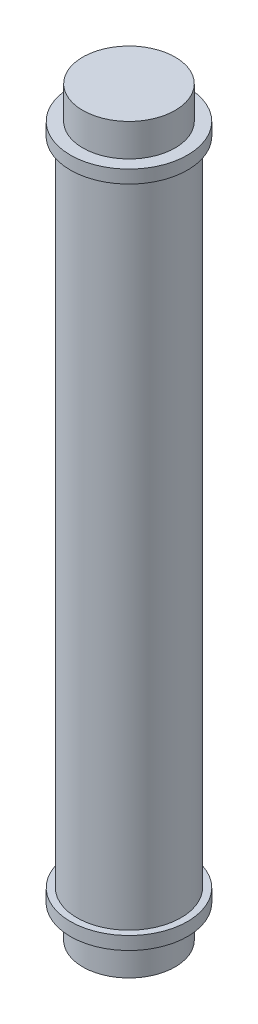
ISO-10303-21;
HEADER;
FILE_DESCRIPTION(('STEP AP214'),'2;1');
FILE_NAME('part.step','',(''),(''),'','','');
FILE_SCHEMA(('AUTOMOTIVE_DESIGN { 1 0 10303 214 1 1 1 1 }'));
ENDSEC;
DATA;
#1=APPLICATION_CONTEXT('core data for automotive mechanical design processes');
#2=APPLICATION_PROTOCOL_DEFINITION('international standard','automotive_design',2000,#1);
#3=PRODUCT_CONTEXT('',#1,'mechanical');
#4=PRODUCT('Part','Part','',(#3));
#5=PRODUCT_RELATED_PRODUCT_CATEGORY('part','',(#4));
#6=PRODUCT_DEFINITION_FORMATION('','',#4);
#7=PRODUCT_DEFINITION_CONTEXT('part definition',#1,'design');
#8=PRODUCT_DEFINITION('design','',#6,#7);
#9=PRODUCT_DEFINITION_SHAPE('','',#8);
#10=(LENGTH_UNIT() NAMED_UNIT(*) SI_UNIT(.MILLI.,.METRE.));
#11=(NAMED_UNIT(*) PLANE_ANGLE_UNIT() SI_UNIT($,.RADIAN.));
#12=(NAMED_UNIT(*) SI_UNIT($,.STERADIAN.) SOLID_ANGLE_UNIT());
#13=UNCERTAINTY_MEASURE_WITH_UNIT(LENGTH_MEASURE(1.E-05),#10,'distance_accuracy_value','');
#14=(GEOMETRIC_REPRESENTATION_CONTEXT(3) GLOBAL_UNCERTAINTY_ASSIGNED_CONTEXT((#13)) GLOBAL_UNIT_ASSIGNED_CONTEXT((#10,
#11,#12)) REPRESENTATION_CONTEXT('',''));
#15=CARTESIAN_POINT('',(0.,0.,0.));
#16=DIRECTION('',(0.,0.,1.));
#17=DIRECTION('',(1.,0.,0.));
#18=AXIS2_PLACEMENT_3D('',#15,#16,#17);
#19=CARTESIAN_POINT('',(0.,12.5,0.));
#20=DIRECTION('',(0.,-1.,0.));
#21=DIRECTION('',(0.,0.,-1.));
#22=AXIS2_PLACEMENT_3D('',#19,#20,#21);
#23=CYLINDRICAL_SURFACE('',#22,2.);
#24=CARTESIAN_POINT('',(0.,12.5,0.));
#25=DIRECTION('',(0.,1.,0.));
#26=DIRECTION('',(0.,0.,1.));
#27=AXIS2_PLACEMENT_3D('',#24,#25,#26);
#28=CIRCLE('',#27,2.);
#29=CARTESIAN_POINT('',(0.,12.5,2.));
#30=VERTEX_POINT('',#29);
#31=EDGE_CURVE('E38',#30,#30,#28,.T.);
#32=ORIENTED_EDGE('',*,*,#31,.F.);
#33=EDGE_LOOP('',(#32));
#34=FACE_BOUND('',#33,.T.);
#35=CARTESIAN_POINT('',(0.,-12.5,0.));
#36=DIRECTION('',(0.,-1.,0.));
#37=DIRECTION('',(0.,0.,-1.));
#38=AXIS2_PLACEMENT_3D('',#35,#36,#37);
#39=CIRCLE('',#38,2.);
#40=CARTESIAN_POINT('',(0.,-12.5,-2.));
#41=VERTEX_POINT('',#40);
#42=EDGE_CURVE('E61',#41,#41,#39,.T.);
#43=ORIENTED_EDGE('',*,*,#42,.F.);
#44=EDGE_LOOP('',(#43));
#45=FACE_BOUND('',#44,.T.);
#46=ADVANCED_FACE('F31',(#34,#45),#23,.T.);
#47=CARTESIAN_POINT('',(0.,13.,0.));
#48=DIRECTION('',(0.,-1.,0.));
#49=DIRECTION('',(0.,0.,-1.));
#50=AXIS2_PLACEMENT_3D('',#47,#48,#49);
#51=CYLINDRICAL_SURFACE('',#50,2.25);
#52=CARTESIAN_POINT('',(0.,13.,0.));
#53=DIRECTION('',(0.,1.,0.));
#54=DIRECTION('',(0.,0.,1.));
#55=AXIS2_PLACEMENT_3D('',#52,#53,#54);
#56=CIRCLE('',#55,2.25);
#57=CARTESIAN_POINT('',(0.,13.,2.25));
#58=VERTEX_POINT('',#57);
#59=EDGE_CURVE('E51',#58,#58,#56,.T.);
#60=ORIENTED_EDGE('',*,*,#59,.F.);
#61=EDGE_LOOP('',(#60));
#62=FACE_BOUND('',#61,.T.);
#63=CARTESIAN_POINT('',(0.,12.5,0.));
#64=DIRECTION('',(0.,1.,0.));
#65=DIRECTION('',(0.,0.,1.));
#66=AXIS2_PLACEMENT_3D('',#63,#64,#65);
#67=CIRCLE('',#66,2.25);
#68=CARTESIAN_POINT('',(0.,12.5,2.25));
#69=VERTEX_POINT('',#68);
#70=EDGE_CURVE('E52',#69,#69,#67,.T.);
#71=ORIENTED_EDGE('',*,*,#70,.T.);
#72=EDGE_LOOP('',(#71));
#73=FACE_BOUND('',#72,.T.);
#74=ADVANCED_FACE('F88',(#62,#73),#51,.T.);
#75=CARTESIAN_POINT('',(0.,13.,0.));
#76=DIRECTION('',(0.,1.,0.));
#77=DIRECTION('',(0.,0.,1.));
#78=AXIS2_PLACEMENT_3D('',#75,#76,#77);
#79=PLANE('',#78);
#80=CARTESIAN_POINT('',(0.,13.,0.));
#81=DIRECTION('',(0.,1.,0.));
#82=DIRECTION('',(0.,0.,1.));
#83=AXIS2_PLACEMENT_3D('',#80,#81,#82);
#84=CIRCLE('',#83,1.775);
#85=CARTESIAN_POINT('',(0.,13.,1.775));
#86=VERTEX_POINT('',#85);
#87=EDGE_CURVE('E58',#86,#86,#84,.T.);
#88=ORIENTED_EDGE('',*,*,#87,.F.);
#89=EDGE_LOOP('',(#88));
#90=FACE_BOUND('',#89,.T.);
#91=ORIENTED_EDGE('',*,*,#59,.T.);
#92=EDGE_LOOP('',(#91));
#93=FACE_BOUND('',#92,.T.);
#94=ADVANCED_FACE('F93',(#90,#93),#79,.T.);
#95=CARTESIAN_POINT('',(0.,12.5,0.));
#96=DIRECTION('',(0.,1.,0.));
#97=DIRECTION('',(0.,0.,1.));
#98=AXIS2_PLACEMENT_3D('',#95,#96,#97);
#99=PLANE('',#98);
#100=ORIENTED_EDGE('',*,*,#31,.T.);
#101=EDGE_LOOP('',(#100));
#102=FACE_BOUND('',#101,.T.);
#103=ORIENTED_EDGE('',*,*,#70,.F.);
#104=EDGE_LOOP('',(#103));
#105=FACE_BOUND('',#104,.T.);
#106=ADVANCED_FACE('F123',(#102,#105),#99,.F.);
#107=CARTESIAN_POINT('',(0.,14.25,0.));
#108=DIRECTION('',(0.,-1.,0.));
#109=DIRECTION('',(0.,0.,-1.));
#110=AXIS2_PLACEMENT_3D('',#107,#108,#109);
#111=CYLINDRICAL_SURFACE('',#110,1.775);
#112=CARTESIAN_POINT('',(0.,14.25,0.));
#113=DIRECTION('',(0.,1.,0.));
#114=DIRECTION('',(0.,0.,1.));
#115=AXIS2_PLACEMENT_3D('',#112,#113,#114);
#116=CIRCLE('',#115,1.775);
#117=CARTESIAN_POINT('',(0.,14.25,1.775));
#118=VERTEX_POINT('',#117);
#119=EDGE_CURVE('E55',#118,#118,#116,.T.);
#120=ORIENTED_EDGE('',*,*,#119,.F.);
#121=EDGE_LOOP('',(#120));
#122=FACE_BOUND('',#121,.T.);
#123=ORIENTED_EDGE('',*,*,#87,.T.);
#124=EDGE_LOOP('',(#123));
#125=FACE_BOUND('',#124,.T.);
#126=ADVANCED_FACE('F117',(#122,#125),#111,.T.);
#127=CARTESIAN_POINT('',(0.,14.25,0.));
#128=DIRECTION('',(0.,1.,0.));
#129=DIRECTION('',(0.,0.,1.));
#130=AXIS2_PLACEMENT_3D('',#127,#128,#129);
#131=PLANE('',#130);
#132=ORIENTED_EDGE('',*,*,#119,.T.);
#133=EDGE_LOOP('',(#132));
#134=FACE_BOUND('',#133,.T.);
#135=ADVANCED_FACE('F108',(#134),#131,.T.);
#136=CARTESIAN_POINT('',(0.,-13.,0.));
#137=DIRECTION('',(0.,1.,0.));
#138=DIRECTION('',(0.,0.,1.));
#139=AXIS2_PLACEMENT_3D('',#136,#137,#138);
#140=CYLINDRICAL_SURFACE('',#139,2.25);
#141=CARTESIAN_POINT('',(0.,-13.,0.));
#142=DIRECTION('',(0.,1.,0.));
#143=DIRECTION('',(0.,0.,1.));
#144=AXIS2_PLACEMENT_3D('',#141,#142,#143);
#145=CIRCLE('',#144,2.25);
#146=CARTESIAN_POINT('',(0.,-13.,2.25));
#147=VERTEX_POINT('',#146);
#148=EDGE_CURVE('E66',#147,#147,#145,.T.);
#149=ORIENTED_EDGE('',*,*,#148,.T.);
#150=EDGE_LOOP('',(#149));
#151=FACE_BOUND('',#150,.T.);
#152=CARTESIAN_POINT('',(0.,-12.5,0.));
#153=DIRECTION('',(0.,1.,0.));
#154=DIRECTION('',(0.,0.,1.));
#155=AXIS2_PLACEMENT_3D('',#152,#153,#154);
#156=CIRCLE('',#155,2.25);
#157=CARTESIAN_POINT('',(0.,-12.5,2.25));
#158=VERTEX_POINT('',#157);
#159=EDGE_CURVE('E67',#158,#158,#156,.T.);
#160=ORIENTED_EDGE('',*,*,#159,.F.);
#161=EDGE_LOOP('',(#160));
#162=FACE_BOUND('',#161,.T.);
#163=ADVANCED_FACE('F106',(#151,#162),#140,.T.);
#164=CARTESIAN_POINT('',(0.,-13.,0.));
#165=DIRECTION('',(0.,-1.,0.));
#166=DIRECTION('',(0.,0.,1.));
#167=AXIS2_PLACEMENT_3D('',#164,#165,#166);
#168=PLANE('',#167);
#169=CARTESIAN_POINT('',(0.,-13.,0.));
#170=DIRECTION('',(0.,-1.,0.));
#171=DIRECTION('',(0.,0.,-1.));
#172=AXIS2_PLACEMENT_3D('',#169,#170,#171);
#173=CIRCLE('',#172,1.775);
#174=CARTESIAN_POINT('',(0.,-13.,-1.775));
#175=VERTEX_POINT('',#174);
#176=EDGE_CURVE('E10',#175,#175,#173,.T.);
#177=ORIENTED_EDGE('',*,*,#176,.F.);
#178=EDGE_LOOP('',(#177));
#179=FACE_BOUND('',#178,.T.);
#180=ORIENTED_EDGE('',*,*,#148,.F.);
#181=EDGE_LOOP('',(#180));
#182=FACE_BOUND('',#181,.T.);
#183=ADVANCED_FACE('F101',(#179,#182),#168,.T.);
#184=CARTESIAN_POINT('',(0.,-12.5,0.));
#185=DIRECTION('',(0.,-1.,0.));
#186=DIRECTION('',(0.,0.,1.));
#187=AXIS2_PLACEMENT_3D('',#184,#185,#186);
#188=PLANE('',#187);
#189=ORIENTED_EDGE('',*,*,#42,.T.);
#190=EDGE_LOOP('',(#189));
#191=FACE_BOUND('',#190,.T.);
#192=ORIENTED_EDGE('',*,*,#159,.T.);
#193=EDGE_LOOP('',(#192));
#194=FACE_BOUND('',#193,.T.);
#195=ADVANCED_FACE('F85',(#191,#194),#188,.F.);
#196=CARTESIAN_POINT('',(0.,-14.25,0.));
#197=DIRECTION('',(0.,1.,0.));
#198=DIRECTION('',(0.,0.,1.));
#199=AXIS2_PLACEMENT_3D('',#196,#197,#198);
#200=CYLINDRICAL_SURFACE('',#199,1.775);
#201=CARTESIAN_POINT('',(0.,-14.25,0.));
#202=DIRECTION('',(0.,1.,0.));
#203=DIRECTION('',(0.,0.,1.));
#204=AXIS2_PLACEMENT_3D('',#201,#202,#203);
#205=CIRCLE('',#204,1.775);
#206=CARTESIAN_POINT('',(0.,-14.25,1.775));
#207=VERTEX_POINT('',#206);
#208=EDGE_CURVE('E70',#207,#207,#205,.T.);
#209=ORIENTED_EDGE('',*,*,#208,.T.);
#210=EDGE_LOOP('',(#209));
#211=FACE_BOUND('',#210,.T.);
#212=ORIENTED_EDGE('',*,*,#176,.T.);
#213=EDGE_LOOP('',(#212));
#214=FACE_BOUND('',#213,.T.);
#215=ADVANCED_FACE('F76',(#211,#214),#200,.T.);
#216=CARTESIAN_POINT('',(0.,-14.25,0.));
#217=DIRECTION('',(0.,-1.,0.));
#218=DIRECTION('',(0.,0.,1.));
#219=AXIS2_PLACEMENT_3D('',#216,#217,#218);
#220=PLANE('',#219);
#221=ORIENTED_EDGE('',*,*,#208,.F.);
#222=EDGE_LOOP('',(#221));
#223=FACE_BOUND('',#222,.T.);
#224=ADVANCED_FACE('F78',(#223),#220,.T.);
#225=CLOSED_SHELL('',(#46,#74,#94,#106,#126,#135,#163,#183,#195,#215,#224));
#226=CARTESIAN_POINT('',(0.,-12.5,0.));
#227=DIRECTION('',(0.,1.,0.));
#228=DIRECTION('',(0.,0.,1.));
#229=AXIS2_PLACEMENT_3D('',#226,#227,#228);
#230=CIRCLE('',#229,1.5);
#231=CARTESIAN_POINT('',(0.,-12.5,1.5));
#232=VERTEX_POINT('',#231);
#233=EDGE_CURVE('E42',#232,#232,#230,.T.);
#234=ORIENTED_EDGE('',*,*,#233,.T.);
#235=EDGE_LOOP('',(#234));
#236=FACE_BOUND('',#235,.T.);
#237=ADVANCED_FACE('F103',(#236),#188,.F.);
#238=CARTESIAN_POINT('',(0.,12.5,0.));
#239=DIRECTION('',(0.,1.,0.));
#240=DIRECTION('',(0.,0.,1.));
#241=AXIS2_PLACEMENT_3D('',#238,#239,#240);
#242=CIRCLE('',#241,1.5);
#243=CARTESIAN_POINT('',(0.,12.5,1.5));
#244=VERTEX_POINT('',#243);
#245=EDGE_CURVE('E46',#244,#244,#242,.T.);
#246=ORIENTED_EDGE('',*,*,#245,.F.);
#247=EDGE_LOOP('',(#246));
#248=FACE_BOUND('',#247,.T.);
#249=ADVANCED_FACE('F129',(#248),#99,.F.);
#250=CARTESIAN_POINT('',(0.,12.5,0.));
#251=DIRECTION('',(0.,-1.,0.));
#252=DIRECTION('',(0.,0.,-1.));
#253=AXIS2_PLACEMENT_3D('',#250,#251,#252);
#254=CYLINDRICAL_SURFACE('',#253,1.5);
#255=ORIENTED_EDGE('',*,*,#245,.T.);
#256=EDGE_LOOP('',(#255));
#257=FACE_BOUND('',#256,.T.);
#258=ORIENTED_EDGE('',*,*,#233,.F.);
#259=EDGE_LOOP('',(#258));
#260=FACE_BOUND('',#259,.T.);
#261=ADVANCED_FACE('F130',(#257,#260),#254,.F.);
#262=CLOSED_SHELL('',(#237,#249,#261));
#263=ORIENTED_CLOSED_SHELL('',*,#262,.T.);
#264=BREP_WITH_VOIDS('B2',#225,(#263));
#265=ADVANCED_BREP_SHAPE_REPRESENTATION('',(#18,#264),#14);
#266=SHAPE_DEFINITION_REPRESENTATION(#9,#265);
ENDSEC;
END-ISO-10303-21;
